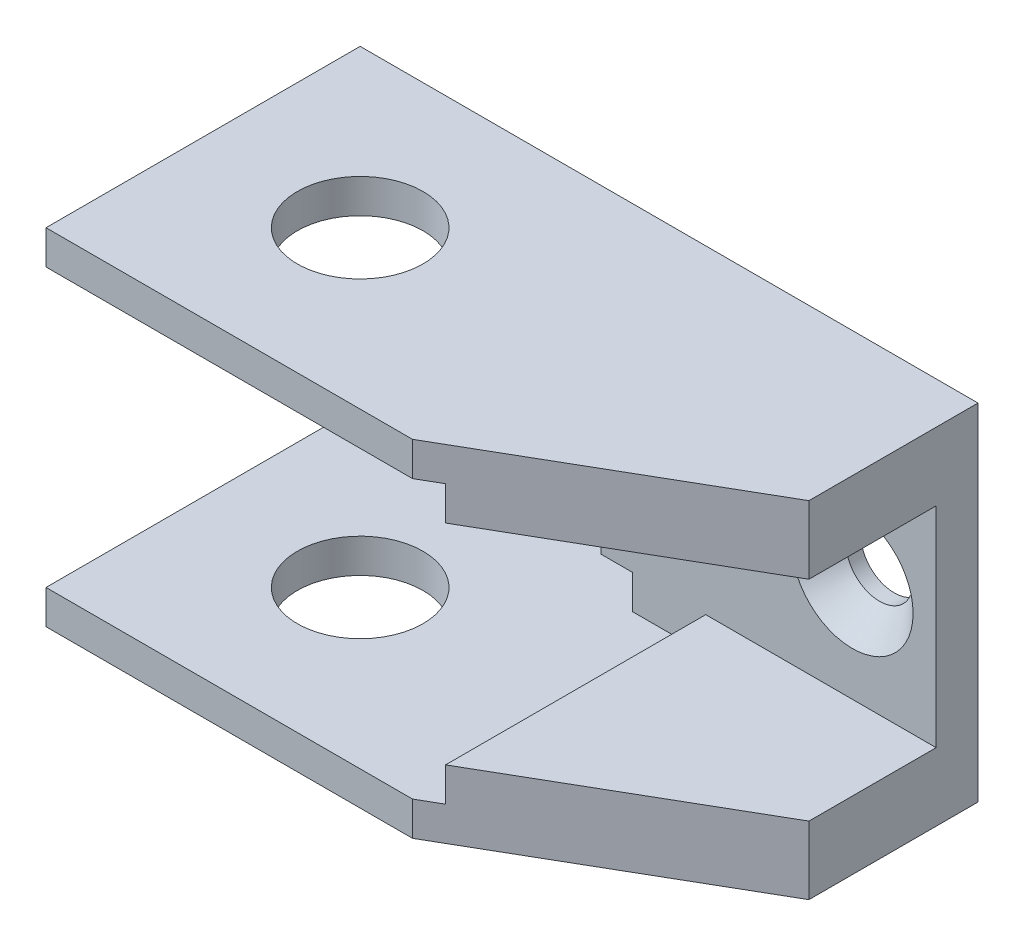
ISO-10303-21;
HEADER;
FILE_DESCRIPTION(('STEP AP214'),'2;1');
FILE_NAME('part.step','',(''),(''),'','','');
FILE_SCHEMA(('AUTOMOTIVE_DESIGN { 1 0 10303 214 1 1 1 1 }'));
ENDSEC;
DATA;
#1=APPLICATION_CONTEXT('core data for automotive mechanical design processes');
#2=APPLICATION_PROTOCOL_DEFINITION('international standard','automotive_design',2000,#1);
#3=PRODUCT_CONTEXT('',#1,'mechanical');
#4=PRODUCT('Part','Part','',(#3));
#5=PRODUCT_RELATED_PRODUCT_CATEGORY('part','',(#4));
#6=PRODUCT_DEFINITION_FORMATION('','',#4);
#7=PRODUCT_DEFINITION_CONTEXT('part definition',#1,'design');
#8=PRODUCT_DEFINITION('design','',#6,#7);
#9=PRODUCT_DEFINITION_SHAPE('','',#8);
#10=(LENGTH_UNIT() NAMED_UNIT(*) SI_UNIT(.MILLI.,.METRE.));
#11=(NAMED_UNIT(*) PLANE_ANGLE_UNIT() SI_UNIT($,.RADIAN.));
#12=(NAMED_UNIT(*) SI_UNIT($,.STERADIAN.) SOLID_ANGLE_UNIT());
#13=UNCERTAINTY_MEASURE_WITH_UNIT(LENGTH_MEASURE(1.E-05),#10,'distance_accuracy_value','');
#14=(GEOMETRIC_REPRESENTATION_CONTEXT(3) GLOBAL_UNCERTAINTY_ASSIGNED_CONTEXT((#13)) GLOBAL_UNIT_ASSIGNED_CONTEXT((#10,
#11,#12)) REPRESENTATION_CONTEXT('',''));
#15=CARTESIAN_POINT('',(0.,0.,0.));
#16=DIRECTION('',(0.,0.,1.));
#17=DIRECTION('',(1.,0.,0.));
#18=AXIS2_PLACEMENT_3D('',#15,#16,#17);
#19=CARTESIAN_POINT('',(7.5,-5.8125,-3.75));
#20=DIRECTION('',(-1.,0.,0.));
#21=DIRECTION('',(0.,0.,1.));
#22=AXIS2_PLACEMENT_3D('',#19,#20,#21);
#23=PLANE('',#22);
#24=DIRECTION('',(0.,1.,0.));
#25=VECTOR('',#24,1.);
#26=CARTESIAN_POINT('',(7.5,-5.8125,-7.5));
#27=LINE('',#26,#25);
#28=CARTESIAN_POINT('',(7.5,-5.,-7.5));
#29=VERTEX_POINT('',#28);
#30=CARTESIAN_POINT('',(7.5,-6.625,-7.5));
#31=VERTEX_POINT('',#30);
#32=EDGE_CURVE('E167',#29,#31,#27,.F.);
#33=ORIENTED_EDGE('',*,*,#32,.T.);
#34=DIRECTION('',(0.,0.,-1.));
#35=VECTOR('',#34,1.);
#36=CARTESIAN_POINT('',(7.5,-6.625,0.));
#37=LINE('',#36,#35);
#38=CARTESIAN_POINT('',(7.5,-6.625,-5.5));
#39=VERTEX_POINT('',#38);
#40=EDGE_CURVE('E245',#31,#39,#37,.F.);
#41=ORIENTED_EDGE('',*,*,#40,.T.);
#42=DIRECTION('',(0.,1.,0.));
#43=VECTOR('',#42,1.);
#44=CARTESIAN_POINT('',(7.5,-5.8125,-5.5));
#45=LINE('',#44,#43);
#46=CARTESIAN_POINT('',(7.5,-5.,-5.5));
#47=VERTEX_POINT('',#46);
#48=EDGE_CURVE('E149',#39,#47,#45,.T.);
#49=ORIENTED_EDGE('',*,*,#48,.T.);
#50=DIRECTION('',(0.,0.,-1.));
#51=VECTOR('',#50,1.);
#52=CARTESIAN_POINT('',(7.5,-5.,-3.75));
#53=LINE('',#52,#51);
#54=EDGE_CURVE('E157',#29,#47,#53,.F.);
#55=ORIENTED_EDGE('',*,*,#54,.F.);
#56=EDGE_LOOP('',(#33,#41,#49,#55));
#57=FACE_BOUND('',#56,.T.);
#58=ADVANCED_FACE('F16',(#57),#23,.T.);
#59=CARTESIAN_POINT('',(3.75,5.,-3.75));
#60=DIRECTION('',(0.,-1.,0.));
#61=DIRECTION('',(0.,0.,-1.));
#62=AXIS2_PLACEMENT_3D('',#59,#60,#61);
#63=PLANE('',#62);
#64=DIRECTION('',(0.,0.,1.));
#65=VECTOR('',#64,1.);
#66=CARTESIAN_POINT('',(7.5,5.,-3.75));
#67=LINE('',#66,#65);
#68=CARTESIAN_POINT('',(7.5,5.,-7.5));
#69=VERTEX_POINT('',#68);
#70=CARTESIAN_POINT('',(7.5,5.,-5.5));
#71=VERTEX_POINT('',#70);
#72=EDGE_CURVE('E256',#69,#71,#67,.T.);
#73=ORIENTED_EDGE('',*,*,#72,.F.);
#74=DIRECTION('',(1.,0.,0.));
#75=VECTOR('',#74,1.);
#76=CARTESIAN_POINT('',(3.75,5.,-7.5));
#77=LINE('',#76,#75);
#78=CARTESIAN_POINT('',(6.,5.,-7.5));
#79=VERTEX_POINT('',#78);
#80=EDGE_CURVE('E173',#79,#69,#77,.T.);
#81=ORIENTED_EDGE('',*,*,#80,.F.);
#82=DIRECTION('',(0.,0.,1.));
#83=VECTOR('',#82,1.);
#84=CARTESIAN_POINT('',(6.,5.,-5.5));
#85=LINE('',#84,#83);
#86=CARTESIAN_POINT('',(6.,5.,-5.5));
#87=VERTEX_POINT('',#86);
#88=EDGE_CURVE('E242',#87,#79,#85,.F.);
#89=ORIENTED_EDGE('',*,*,#88,.F.);
#90=DIRECTION('',(1.,0.,0.));
#91=VECTOR('',#90,1.);
#92=CARTESIAN_POINT('',(3.75,5.,-5.5));
#93=LINE('',#92,#91);
#94=EDGE_CURVE('E164',#71,#87,#93,.F.);
#95=ORIENTED_EDGE('',*,*,#94,.F.);
#96=EDGE_LOOP('',(#73,#81,#89,#95));
#97=FACE_BOUND('',#96,.T.);
#98=ADVANCED_FACE('F377',(#97),#63,.F.);
#99=CARTESIAN_POINT('',(3.75,-5.,-3.75));
#100=DIRECTION('',(0.,-1.,0.));
#101=DIRECTION('',(0.,0.,-1.));
#102=AXIS2_PLACEMENT_3D('',#99,#100,#101);
#103=PLANE('',#102);
#104=ORIENTED_EDGE('',*,*,#54,.T.);
#105=DIRECTION('',(1.,0.,0.));
#106=VECTOR('',#105,1.);
#107=CARTESIAN_POINT('',(3.75,-5.,-5.5));
#108=LINE('',#107,#106);
#109=CARTESIAN_POINT('',(6.,-5.,-5.5));
#110=VERTEX_POINT('',#109);
#111=EDGE_CURVE('E175',#47,#110,#108,.F.);
#112=ORIENTED_EDGE('',*,*,#111,.T.);
#113=DIRECTION('',(0.,0.,1.));
#114=VECTOR('',#113,1.);
#115=CARTESIAN_POINT('',(6.,-5.,-5.5));
#116=LINE('',#115,#114);
#117=CARTESIAN_POINT('',(6.,-5.,-7.5));
#118=VERTEX_POINT('',#117);
#119=EDGE_CURVE('E160',#118,#110,#116,.T.);
#120=ORIENTED_EDGE('',*,*,#119,.F.);
#121=DIRECTION('',(1.,0.,0.));
#122=VECTOR('',#121,1.);
#123=CARTESIAN_POINT('',(3.75,-5.,-7.5));
#124=LINE('',#123,#122);
#125=EDGE_CURVE('E154',#118,#29,#124,.T.);
#126=ORIENTED_EDGE('',*,*,#125,.T.);
#127=EDGE_LOOP('',(#104,#112,#120,#126));
#128=FACE_BOUND('',#127,.T.);
#129=ADVANCED_FACE('F156',(#128),#103,.T.);
#130=CARTESIAN_POINT('',(11.,0.,0.));
#131=DIRECTION('',(-1.,0.,0.));
#132=DIRECTION('',(0.,0.,1.));
#133=AXIS2_PLACEMENT_3D('',#130,#131,#132);
#134=PLANE('',#133);
#135=DIRECTION('',(0.,1.,0.));
#136=VECTOR('',#135,1.);
#137=CARTESIAN_POINT('',(11.,0.,6.92264973081037));
#138=LINE('',#137,#136);
#139=CARTESIAN_POINT('',(11.,-6.625,6.92264973081037));
#140=VERTEX_POINT('',#139);
#141=CARTESIAN_POINT('',(11.,-5.,6.92264973081037));
#142=VERTEX_POINT('',#141);
#143=EDGE_CURVE('E266',#140,#142,#138,.T.);
#144=ORIENTED_EDGE('',*,*,#143,.T.);
#145=DIRECTION('',(0.,0.,-1.));
#146=VECTOR('',#145,1.);
#147=CARTESIAN_POINT('',(11.,-5.,0.));
#148=LINE('',#147,#146);
#149=CARTESIAN_POINT('',(11.,-5.,-5.5));
#150=VERTEX_POINT('',#149);
#151=EDGE_CURVE('E238',#142,#150,#148,.T.);
#152=ORIENTED_EDGE('',*,*,#151,.T.);
#153=DIRECTION('',(0.,1.,0.));
#154=VECTOR('',#153,1.);
#155=CARTESIAN_POINT('',(11.,0.,-5.5));
#156=LINE('',#155,#154);
#157=CARTESIAN_POINT('',(11.,-6.625,-5.5));
#158=VERTEX_POINT('',#157);
#159=EDGE_CURVE('E177',#150,#158,#156,.F.);
#160=ORIENTED_EDGE('',*,*,#159,.T.);
#161=DIRECTION('',(0.,0.,-1.));
#162=VECTOR('',#161,1.);
#163=CARTESIAN_POINT('',(11.,-6.625,0.));
#164=LINE('',#163,#162);
#165=EDGE_CURVE('E188',#158,#140,#164,.F.);
#166=ORIENTED_EDGE('',*,*,#165,.T.);
#167=EDGE_LOOP('',(#144,#152,#160,#166));
#168=FACE_BOUND('',#167,.T.);
#169=ADVANCED_FACE('F269',(#168),#134,.T.);
#170=CARTESIAN_POINT('',(0.,0.,0.));
#171=DIRECTION('',(0.,-1.,0.));
#172=DIRECTION('',(0.,0.,-1.));
#173=AXIS2_PLACEMENT_3D('',#170,#171,#172);
#174=CYLINDRICAL_SURFACE('',#173,3.);
#175=CARTESIAN_POINT('',(0.,-8.25,0.));
#176=DIRECTION('',(0.,-1.,0.));
#177=DIRECTION('',(0.,0.,-1.));
#178=AXIS2_PLACEMENT_3D('',#175,#176,#177);
#179=CIRCLE('',#178,3.);
#180=CARTESIAN_POINT('',(0.,-8.25,-3.));
#181=VERTEX_POINT('',#180);
#182=EDGE_CURVE('E217',#181,#181,#179,.F.);
#183=ORIENTED_EDGE('',*,*,#182,.F.);
#184=EDGE_LOOP('',(#183));
#185=FACE_BOUND('',#184,.T.);
#186=CARTESIAN_POINT('',(0.,-6.625,0.));
#187=DIRECTION('',(0.,-1.,0.));
#188=DIRECTION('',(0.,0.,-1.));
#189=AXIS2_PLACEMENT_3D('',#186,#187,#188);
#190=CIRCLE('',#189,3.);
#191=CARTESIAN_POINT('',(0.,-6.625,-3.));
#192=VERTEX_POINT('',#191);
#193=EDGE_CURVE('E19',#192,#192,#190,.F.);
#194=ORIENTED_EDGE('',*,*,#193,.T.);
#195=EDGE_LOOP('',(#194));
#196=FACE_BOUND('',#195,.T.);
#197=ADVANCED_FACE('F484',(#185,#196),#174,.F.);
#198=CARTESIAN_POINT('',(10.,-8.25,7.5));
#199=DIRECTION('',(0.,0.,1.));
#200=DIRECTION('',(1.,0.,0.));
#201=AXIS2_PLACEMENT_3D('',#198,#199,#200);
#202=PLANE('',#201);
#203=DIRECTION('',(1.,0.,0.));
#204=VECTOR('',#203,1.);
#205=CARTESIAN_POINT('',(7.61195926998478,-8.25,7.5));
#206=LINE('',#205,#204);
#207=CARTESIAN_POINT('',(10.,-8.25,7.5));
#208=VERTEX_POINT('',#207);
#209=CARTESIAN_POINT('',(-7.5,-8.25,7.5));
#210=VERTEX_POINT('',#209);
#211=EDGE_CURVE('E224',#208,#210,#206,.F.);
#212=ORIENTED_EDGE('',*,*,#211,.F.);
#213=DIRECTION('',(0.,1.,0.));
#214=VECTOR('',#213,1.);
#215=CARTESIAN_POINT('',(10.,-8.25,7.5));
#216=LINE('',#215,#214);
#217=CARTESIAN_POINT('',(10.,-6.625,7.5));
#218=VERTEX_POINT('',#217);
#219=EDGE_CURVE('E220',#218,#208,#216,.F.);
#220=ORIENTED_EDGE('',*,*,#219,.F.);
#221=DIRECTION('',(1.,0.,0.));
#222=VECTOR('',#221,1.);
#223=CARTESIAN_POINT('',(1.75,-6.625,7.5));
#224=LINE('',#223,#222);
#225=CARTESIAN_POINT('',(-7.5,-6.625,7.5));
#226=VERTEX_POINT('',#225);
#227=EDGE_CURVE('E250',#218,#226,#224,.F.);
#228=ORIENTED_EDGE('',*,*,#227,.T.);
#229=DIRECTION('',(0.,1.,0.));
#230=VECTOR('',#229,1.);
#231=CARTESIAN_POINT('',(-7.5,0.,7.5));
#232=LINE('',#231,#230);
#233=EDGE_CURVE('E263',#226,#210,#232,.F.);
#234=ORIENTED_EDGE('',*,*,#233,.T.);
#235=EDGE_LOOP('',(#212,#220,#228,#234));
#236=FACE_BOUND('',#235,.T.);
#237=ADVANCED_FACE('F300',(#236),#202,.T.);
#238=CARTESIAN_POINT('',(-7.5,0.,0.));
#239=DIRECTION('',(1.,0.,0.));
#240=DIRECTION('',(0.,0.,-1.));
#241=AXIS2_PLACEMENT_3D('',#238,#239,#240);
#242=PLANE('',#241);
#243=DIRECTION('',(0.,1.,0.));
#244=VECTOR('',#243,1.);
#245=CARTESIAN_POINT('',(-7.5,0.,-7.5));
#246=LINE('',#245,#244);
#247=CARTESIAN_POINT('',(-7.5,-8.25,-7.5));
#248=VERTEX_POINT('',#247);
#249=CARTESIAN_POINT('',(-7.5,-6.625,-7.5));
#250=VERTEX_POINT('',#249);
#251=EDGE_CURVE('E261',#248,#250,#246,.T.);
#252=ORIENTED_EDGE('',*,*,#251,.F.);
#253=DIRECTION('',(0.,0.,-1.));
#254=VECTOR('',#253,1.);
#255=CARTESIAN_POINT('',(-7.5,-8.25,-0.800598234334194));
#256=LINE('',#255,#254);
#257=EDGE_CURVE('E287',#210,#248,#256,.T.);
#258=ORIENTED_EDGE('',*,*,#257,.F.);
#259=ORIENTED_EDGE('',*,*,#233,.F.);
#260=DIRECTION('',(0.,0.,-1.));
#261=VECTOR('',#260,1.);
#262=CARTESIAN_POINT('',(-7.5,-6.625,0.));
#263=LINE('',#262,#261);
#264=EDGE_CURVE('E247',#226,#250,#263,.T.);
#265=ORIENTED_EDGE('',*,*,#264,.T.);
#266=EDGE_LOOP('',(#252,#258,#259,#265));
#267=FACE_BOUND('',#266,.T.);
#268=ADVANCED_FACE('F303',(#267),#242,.F.);
#269=CARTESIAN_POINT('',(10.,0.,-5.50000000004047));
#270=DIRECTION('',(0.,0.,1.));
#271=DIRECTION('',(1.,0.,0.));
#272=AXIS2_PLACEMENT_3D('',#269,#270,#271);
#273=CONICAL_SURFACE('',#272,2.89999999988822,0.785398163419311);
#274=CARTESIAN_POINT('',(10.,0.,-5.49999999997453));
#275=DIRECTION('',(0.,0.,1.));
#276=DIRECTION('',(1.,0.,0.));
#277=AXIS2_PLACEMENT_3D('',#274,#275,#276);
#278=CIRCLE('',#277,2.89999999995416);
#279=CARTESIAN_POINT('',(12.8999999999542,0.,-5.49999999997453));
#280=VERTEX_POINT('',#279);
#281=EDGE_CURVE('E214',#280,#280,#278,.F.);
#282=ORIENTED_EDGE('',*,*,#281,.F.);
#283=EDGE_LOOP('',(#282));
#284=FACE_BOUND('',#283,.T.);
#285=CARTESIAN_POINT('',(10.,0.,-6.8));
#286=DIRECTION('',(0.,0.,-1.));
#287=DIRECTION('',(-1.,0.,0.));
#288=AXIS2_PLACEMENT_3D('',#285,#286,#287);
#289=CIRCLE('',#288,1.6);
#290=CARTESIAN_POINT('',(8.4,0.,-6.8));
#291=VERTEX_POINT('',#290);
#292=EDGE_CURVE('E189',#291,#291,#289,.T.);
#293=ORIENTED_EDGE('',*,*,#292,.T.);
#294=EDGE_LOOP('',(#293));
#295=FACE_BOUND('',#294,.T.);
#296=ADVANCED_FACE('F453',(#284,#295),#273,.F.);
#297=CARTESIAN_POINT('',(18.,0.,-5.49999999992679));
#298=DIRECTION('',(0.,0.,1.));
#299=DIRECTION('',(1.,0.,0.));
#300=AXIS2_PLACEMENT_3D('',#297,#298,#299);
#301=CONICAL_SURFACE('',#300,2.89999999998326,0.785398163419311);
#302=CARTESIAN_POINT('',(18.,0.,-5.49999999995589));
#303=DIRECTION('',(0.,0.,1.));
#304=DIRECTION('',(1.,0.,0.));
#305=AXIS2_PLACEMENT_3D('',#302,#303,#304);
#306=CIRCLE('',#305,2.89999999995416);
#307=CARTESIAN_POINT('',(20.8999999999542,0.,-5.49999999995589));
#308=VERTEX_POINT('',#307);
#309=EDGE_CURVE('E210',#308,#308,#306,.F.);
#310=ORIENTED_EDGE('',*,*,#309,.F.);
#311=EDGE_LOOP('',(#310));
#312=FACE_BOUND('',#311,.T.);
#313=CARTESIAN_POINT('',(18.,0.,-6.8));
#314=DIRECTION('',(0.,0.,-1.));
#315=DIRECTION('',(-1.,0.,0.));
#316=AXIS2_PLACEMENT_3D('',#313,#314,#315);
#317=CIRCLE('',#316,1.6);
#318=CARTESIAN_POINT('',(16.4,0.,-6.8));
#319=VERTEX_POINT('',#318);
#320=EDGE_CURVE('E185',#319,#319,#317,.T.);
#321=ORIENTED_EDGE('',*,*,#320,.T.);
#322=EDGE_LOOP('',(#321));
#323=FACE_BOUND('',#322,.T.);
#324=ADVANCED_FACE('F456',(#312,#323),#301,.F.);
#325=CARTESIAN_POINT('',(7.5,5.8125,-3.75));
#326=DIRECTION('',(-1.,0.,0.));
#327=DIRECTION('',(0.,0.,1.));
#328=AXIS2_PLACEMENT_3D('',#325,#326,#327);
#329=PLANE('',#328);
#330=DIRECTION('',(0.,1.,0.));
#331=VECTOR('',#330,1.);
#332=CARTESIAN_POINT('',(7.5,5.8125,-7.5));
#333=LINE('',#332,#331);
#334=CARTESIAN_POINT('',(7.5,6.625,-7.5));
#335=VERTEX_POINT('',#334);
#336=EDGE_CURVE('E259',#335,#69,#333,.F.);
#337=ORIENTED_EDGE('',*,*,#336,.T.);
#338=ORIENTED_EDGE('',*,*,#72,.T.);
#339=DIRECTION('',(0.,1.,0.));
#340=VECTOR('',#339,1.);
#341=CARTESIAN_POINT('',(7.5,-6.625,-5.5));
#342=LINE('',#341,#340);
#343=CARTESIAN_POINT('',(7.5,6.625,-5.5));
#344=VERTEX_POINT('',#343);
#345=EDGE_CURVE('E216',#344,#71,#342,.F.);
#346=ORIENTED_EDGE('',*,*,#345,.F.);
#347=DIRECTION('',(0.,0.,-1.));
#348=VECTOR('',#347,1.);
#349=CARTESIAN_POINT('',(7.5,6.625,0.));
#350=LINE('',#349,#348);
#351=EDGE_CURVE('E319',#335,#344,#350,.F.);
#352=ORIENTED_EDGE('',*,*,#351,.F.);
#353=EDGE_LOOP('',(#337,#338,#346,#352));
#354=FACE_BOUND('',#353,.T.);
#355=ADVANCED_FACE('F379',(#354),#329,.T.);
#356=CARTESIAN_POINT('',(11.,0.,0.));
#357=DIRECTION('',(-1.,0.,0.));
#358=DIRECTION('',(0.,0.,1.));
#359=AXIS2_PLACEMENT_3D('',#356,#357,#358);
#360=PLANE('',#359);
#361=DIRECTION('',(0.,1.,0.));
#362=VECTOR('',#361,1.);
#363=CARTESIAN_POINT('',(11.,0.,6.92264973081037));
#364=LINE('',#363,#362);
#365=CARTESIAN_POINT('',(11.,5.,6.92264973081037));
#366=VERTEX_POINT('',#365);
#367=CARTESIAN_POINT('',(11.,6.625,6.92264973081037));
#368=VERTEX_POINT('',#367);
#369=EDGE_CURVE('E192',#366,#368,#364,.T.);
#370=ORIENTED_EDGE('',*,*,#369,.T.);
#371=DIRECTION('',(0.,0.,-1.));
#372=VECTOR('',#371,1.);
#373=CARTESIAN_POINT('',(11.,6.625,0.));
#374=LINE('',#373,#372);
#375=CARTESIAN_POINT('',(11.,6.625,-5.5));
#376=VERTEX_POINT('',#375);
#377=EDGE_CURVE('E209',#376,#368,#374,.F.);
#378=ORIENTED_EDGE('',*,*,#377,.F.);
#379=DIRECTION('',(0.,1.,0.));
#380=VECTOR('',#379,1.);
#381=CARTESIAN_POINT('',(11.,-6.625,-5.5));
#382=LINE('',#381,#380);
#383=CARTESIAN_POINT('',(11.,5.,-5.5));
#384=VERTEX_POINT('',#383);
#385=EDGE_CURVE('E284',#384,#376,#382,.T.);
#386=ORIENTED_EDGE('',*,*,#385,.F.);
#387=DIRECTION('',(0.,0.,-1.));
#388=VECTOR('',#387,1.);
#389=CARTESIAN_POINT('',(11.,5.,0.));
#390=LINE('',#389,#388);
#391=EDGE_CURVE('E321',#366,#384,#390,.T.);
#392=ORIENTED_EDGE('',*,*,#391,.F.);
#393=EDGE_LOOP('',(#370,#378,#386,#392));
#394=FACE_BOUND('',#393,.T.);
#395=ADVANCED_FACE('F338',(#394),#360,.T.);
#396=CARTESIAN_POINT('',(10.,0.,-7.15));
#397=DIRECTION('',(0.,0.,-1.));
#398=DIRECTION('',(-1.,0.,0.));
#399=AXIS2_PLACEMENT_3D('',#396,#397,#398);
#400=CYLINDRICAL_SURFACE('',#399,1.6);
#401=CARTESIAN_POINT('',(10.,0.,-7.5));
#402=DIRECTION('',(0.,0.,-1.));
#403=DIRECTION('',(-1.,0.,0.));
#404=AXIS2_PLACEMENT_3D('',#401,#402,#403);
#405=CIRCLE('',#404,1.6);
#406=CARTESIAN_POINT('',(8.4,0.,-7.5));
#407=VERTEX_POINT('',#406);
#408=EDGE_CURVE('E202',#407,#407,#405,.F.);
#409=ORIENTED_EDGE('',*,*,#408,.F.);
#410=EDGE_LOOP('',(#409));
#411=FACE_BOUND('',#410,.T.);
#412=ORIENTED_EDGE('',*,*,#292,.F.);
#413=EDGE_LOOP('',(#412));
#414=FACE_BOUND('',#413,.T.);
#415=ADVANCED_FACE('F460',(#411,#414),#400,.F.);
#416=CARTESIAN_POINT('',(18.,0.,-7.15));
#417=DIRECTION('',(0.,0.,-1.));
#418=DIRECTION('',(-1.,0.,0.));
#419=AXIS2_PLACEMENT_3D('',#416,#417,#418);
#420=CYLINDRICAL_SURFACE('',#419,1.6);
#421=CARTESIAN_POINT('',(18.,0.,-7.5));
#422=DIRECTION('',(0.,0.,-1.));
#423=DIRECTION('',(-1.,0.,0.));
#424=AXIS2_PLACEMENT_3D('',#421,#422,#423);
#425=CIRCLE('',#424,1.6);
#426=CARTESIAN_POINT('',(16.4,0.,-7.5));
#427=VERTEX_POINT('',#426);
#428=EDGE_CURVE('E198',#427,#427,#425,.F.);
#429=ORIENTED_EDGE('',*,*,#428,.F.);
#430=EDGE_LOOP('',(#429));
#431=FACE_BOUND('',#430,.T.);
#432=ORIENTED_EDGE('',*,*,#320,.F.);
#433=EDGE_LOOP('',(#432));
#434=FACE_BOUND('',#433,.T.);
#435=ADVANCED_FACE('F462',(#431,#434),#420,.F.);
#436=CARTESIAN_POINT('',(1.75,-6.625,0.));
#437=DIRECTION('',(0.,-1.,0.));
#438=DIRECTION('',(0.,0.,-1.));
#439=AXIS2_PLACEMENT_3D('',#436,#437,#438);
#440=PLANE('',#439);
#441=ORIENTED_EDGE('',*,*,#193,.F.);
#442=EDGE_LOOP('',(#441));
#443=FACE_BOUND('',#442,.T.);
#444=ORIENTED_EDGE('',*,*,#40,.F.);
#445=DIRECTION('',(-1.,0.,0.));
#446=VECTOR('',#445,1.);
#447=CARTESIAN_POINT('',(0.,-6.625,-7.5));
#448=LINE('',#447,#446);
#449=EDGE_CURVE('E171',#250,#31,#448,.F.);
#450=ORIENTED_EDGE('',*,*,#449,.F.);
#451=ORIENTED_EDGE('',*,*,#264,.F.);
#452=ORIENTED_EDGE('',*,*,#227,.F.);
#453=DIRECTION('',(0.866025403784439,0.,-0.5));
#454=VECTOR('',#453,1.);
#455=CARTESIAN_POINT('',(22.,-6.625,0.571796769724493));
#456=LINE('',#455,#454);
#457=EDGE_CURVE('E226',#140,#218,#456,.F.);
#458=ORIENTED_EDGE('',*,*,#457,.F.);
#459=ORIENTED_EDGE('',*,*,#165,.F.);
#460=DIRECTION('',(1.,0.,0.));
#461=VECTOR('',#460,1.);
#462=CARTESIAN_POINT('',(22.,-6.625,-5.5));
#463=LINE('',#462,#461);
#464=EDGE_CURVE('E278',#39,#158,#463,.T.);
#465=ORIENTED_EDGE('',*,*,#464,.F.);
#466=EDGE_LOOP('',(#444,#450,#451,#452,#458,#459,#465));
#467=FACE_BOUND('',#466,.T.);
#468=ADVANCED_FACE('F277',(#443,#467),#440,.F.);
#469=CARTESIAN_POINT('',(6.,-6.625,-5.5));
#470=DIRECTION('',(-1.,0.,0.));
#471=DIRECTION('',(0.,0.,1.));
#472=AXIS2_PLACEMENT_3D('',#469,#470,#471);
#473=PLANE('',#472);
#474=ORIENTED_EDGE('',*,*,#119,.T.);
#475=DIRECTION('',(0.,1.,0.));
#476=VECTOR('',#475,1.);
#477=CARTESIAN_POINT('',(6.,-6.625,-5.5));
#478=LINE('',#477,#476);
#479=EDGE_CURVE('E282',#87,#110,#478,.F.);
#480=ORIENTED_EDGE('',*,*,#479,.F.);
#481=ORIENTED_EDGE('',*,*,#88,.T.);
#482=DIRECTION('',(0.,1.,0.));
#483=VECTOR('',#482,1.);
#484=CARTESIAN_POINT('',(6.,-8.25,-7.5));
#485=LINE('',#484,#483);
#486=EDGE_CURVE('E308',#118,#79,#485,.T.);
#487=ORIENTED_EDGE('',*,*,#486,.F.);
#488=EDGE_LOOP('',(#474,#480,#481,#487));
#489=FACE_BOUND('',#488,.T.);
#490=ADVANCED_FACE('F373',(#489),#473,.T.);
#491=CARTESIAN_POINT('',(9.5,-5.,0.));
#492=DIRECTION('',(0.,-1.,0.));
#493=DIRECTION('',(0.,0.,-1.));
#494=AXIS2_PLACEMENT_3D('',#491,#492,#493);
#495=PLANE('',#494);
#496=ORIENTED_EDGE('',*,*,#151,.F.);
#497=DIRECTION('',(0.866025403784439,0.,-0.5));
#498=VECTOR('',#497,1.);
#499=CARTESIAN_POINT('',(22.,-5.,0.571796769724493));
#500=LINE('',#499,#498);
#501=CARTESIAN_POINT('',(22.,-5.,0.571796769724493));
#502=VERTEX_POINT('',#501);
#503=EDGE_CURVE('E232',#502,#142,#500,.F.);
#504=ORIENTED_EDGE('',*,*,#503,.F.);
#505=DIRECTION('',(0.,0.,-1.));
#506=VECTOR('',#505,1.);
#507=CARTESIAN_POINT('',(22.,-5.,-7.5));
#508=LINE('',#507,#506);
#509=CARTESIAN_POINT('',(22.,-5.,-5.5));
#510=VERTEX_POINT('',#509);
#511=EDGE_CURVE('E366',#510,#502,#508,.F.);
#512=ORIENTED_EDGE('',*,*,#511,.F.);
#513=DIRECTION('',(1.,0.,0.));
#514=VECTOR('',#513,1.);
#515=CARTESIAN_POINT('',(22.,-5.,-5.5));
#516=LINE('',#515,#514);
#517=EDGE_CURVE('E281',#150,#510,#516,.T.);
#518=ORIENTED_EDGE('',*,*,#517,.F.);
#519=EDGE_LOOP('',(#496,#504,#512,#518));
#520=FACE_BOUND('',#519,.T.);
#521=ADVANCED_FACE('F409',(#520),#495,.F.);
#522=CARTESIAN_POINT('',(22.,-8.25,0.571796769724493));
#523=DIRECTION('',(0.5,0.,0.866025403784439));
#524=DIRECTION('',(0.866025403784439,0.,-0.5));
#525=AXIS2_PLACEMENT_3D('',#522,#523,#524);
#526=PLANE('',#525);
#527=DIRECTION('',(-0.866025403784439,0.,0.5));
#528=VECTOR('',#527,1.);
#529=CARTESIAN_POINT('',(22.,-8.25,0.571796769724493));
#530=LINE('',#529,#528);
#531=CARTESIAN_POINT('',(22.,-8.25,0.571796769724493));
#532=VERTEX_POINT('',#531);
#533=EDGE_CURVE('E219',#532,#208,#530,.T.);
#534=ORIENTED_EDGE('',*,*,#533,.F.);
#535=DIRECTION('',(0.,1.,0.));
#536=VECTOR('',#535,1.);
#537=CARTESIAN_POINT('',(22.,-8.25,0.571796769724494));
#538=LINE('',#537,#536);
#539=EDGE_CURVE('E364',#502,#532,#538,.F.);
#540=ORIENTED_EDGE('',*,*,#539,.F.);
#541=ORIENTED_EDGE('',*,*,#503,.T.);
#542=ORIENTED_EDGE('',*,*,#143,.F.);
#543=ORIENTED_EDGE('',*,*,#457,.T.);
#544=ORIENTED_EDGE('',*,*,#219,.T.);
#545=EDGE_LOOP('',(#534,#540,#541,#542,#543,#544));
#546=FACE_BOUND('',#545,.T.);
#547=ADVANCED_FACE('F407',(#546),#526,.T.);
#548=CARTESIAN_POINT('',(7.61195926998478,-8.25,-0.800598234334194));
#549=DIRECTION('',(0.,-1.,0.));
#550=DIRECTION('',(0.,0.,-1.));
#551=AXIS2_PLACEMENT_3D('',#548,#549,#550);
#552=PLANE('',#551);
#553=ORIENTED_EDGE('',*,*,#211,.T.);
#554=ORIENTED_EDGE('',*,*,#257,.T.);
#555=DIRECTION('',(-1.,0.,0.));
#556=VECTOR('',#555,1.);
#557=CARTESIAN_POINT('',(0.,-8.25,-7.5));
#558=LINE('',#557,#556);
#559=CARTESIAN_POINT('',(22.,-8.25,-7.5));
#560=VERTEX_POINT('',#559);
#561=EDGE_CURVE('E201',#560,#248,#558,.T.);
#562=ORIENTED_EDGE('',*,*,#561,.F.);
#563=DIRECTION('',(0.,0.,-1.));
#564=VECTOR('',#563,1.);
#565=CARTESIAN_POINT('',(22.,-8.25,-7.5));
#566=LINE('',#565,#564);
#567=EDGE_CURVE('E362',#532,#560,#566,.T.);
#568=ORIENTED_EDGE('',*,*,#567,.F.);
#569=ORIENTED_EDGE('',*,*,#533,.T.);
#570=EDGE_LOOP('',(#553,#554,#562,#568,#569));
#571=FACE_BOUND('',#570,.T.);
#572=ORIENTED_EDGE('',*,*,#182,.T.);
#573=EDGE_LOOP('',(#572));
#574=FACE_BOUND('',#573,.T.);
#575=ADVANCED_FACE('F294',(#571,#574),#552,.T.);
#576=CARTESIAN_POINT('',(22.,-6.625,-5.5));
#577=DIRECTION('',(0.,0.,1.));
#578=DIRECTION('',(1.,0.,0.));
#579=AXIS2_PLACEMENT_3D('',#576,#577,#578);
#580=PLANE('',#579);
#581=ORIENTED_EDGE('',*,*,#309,.T.);
#582=EDGE_LOOP('',(#581));
#583=FACE_BOUND('',#582,.T.);
#584=ORIENTED_EDGE('',*,*,#281,.T.);
#585=EDGE_LOOP('',(#584));
#586=FACE_BOUND('',#585,.T.);
#587=DIRECTION('',(1.,0.,0.));
#588=VECTOR('',#587,1.);
#589=CARTESIAN_POINT('',(1.75,6.625,-5.5));
#590=LINE('',#589,#588);
#591=EDGE_CURVE('E316',#344,#376,#590,.T.);
#592=ORIENTED_EDGE('',*,*,#591,.F.);
#593=ORIENTED_EDGE('',*,*,#345,.T.);
#594=ORIENTED_EDGE('',*,*,#94,.T.);
#595=ORIENTED_EDGE('',*,*,#479,.T.);
#596=ORIENTED_EDGE('',*,*,#111,.F.);
#597=ORIENTED_EDGE('',*,*,#48,.F.);
#598=ORIENTED_EDGE('',*,*,#464,.T.);
#599=ORIENTED_EDGE('',*,*,#159,.F.);
#600=ORIENTED_EDGE('',*,*,#517,.T.);
#601=DIRECTION('',(0.,1.,0.));
#602=VECTOR('',#601,1.);
#603=CARTESIAN_POINT('',(22.,-8.25,-5.5));
#604=LINE('',#603,#602);
#605=CARTESIAN_POINT('',(22.,5.,-5.5));
#606=VERTEX_POINT('',#605);
#607=EDGE_CURVE('E355',#606,#510,#604,.F.);
#608=ORIENTED_EDGE('',*,*,#607,.F.);
#609=DIRECTION('',(1.,0.,0.));
#610=VECTOR('',#609,1.);
#611=CARTESIAN_POINT('',(9.5,5.,-5.5));
#612=LINE('',#611,#610);
#613=EDGE_CURVE('E213',#384,#606,#612,.T.);
#614=ORIENTED_EDGE('',*,*,#613,.F.);
#615=ORIENTED_EDGE('',*,*,#385,.T.);
#616=EDGE_LOOP('',(#592,#593,#594,#595,#596,#597,#598,#599,#600,#608,#614,#615));
#617=FACE_BOUND('',#616,.T.);
#618=ADVANCED_FACE('F280',(#583,#586,#617),#580,.T.);
#619=CARTESIAN_POINT('',(9.5,5.,0.));
#620=DIRECTION('',(0.,-1.,0.));
#621=DIRECTION('',(0.,0.,-1.));
#622=AXIS2_PLACEMENT_3D('',#619,#620,#621);
#623=PLANE('',#622);
#624=DIRECTION('',(0.866025403784439,0.,-0.5));
#625=VECTOR('',#624,1.);
#626=CARTESIAN_POINT('',(22.,5.00000000000001,0.571796769724493));
#627=LINE('',#626,#625);
#628=CARTESIAN_POINT('',(22.,5.,0.571796769724493));
#629=VERTEX_POINT('',#628);
#630=EDGE_CURVE('E342',#366,#629,#627,.T.);
#631=ORIENTED_EDGE('',*,*,#630,.F.);
#632=ORIENTED_EDGE('',*,*,#391,.T.);
#633=ORIENTED_EDGE('',*,*,#613,.T.);
#634=DIRECTION('',(0.,0.,-1.));
#635=VECTOR('',#634,1.);
#636=CARTESIAN_POINT('',(22.,5.,-7.5));
#637=LINE('',#636,#635);
#638=EDGE_CURVE('E358',#629,#606,#637,.T.);
#639=ORIENTED_EDGE('',*,*,#638,.F.);
#640=EDGE_LOOP('',(#631,#632,#633,#639));
#641=FACE_BOUND('',#640,.T.);
#642=ADVANCED_FACE('F440',(#641),#623,.T.);
#643=CARTESIAN_POINT('',(1.75,6.625,0.));
#644=DIRECTION('',(0.,-1.,0.));
#645=DIRECTION('',(0.,0.,-1.));
#646=AXIS2_PLACEMENT_3D('',#643,#644,#645);
#647=PLANE('',#646);
#648=CARTESIAN_POINT('',(0.,6.625,0.));
#649=DIRECTION('',(0.,-1.,0.));
#650=DIRECTION('',(0.,0.,-1.));
#651=AXIS2_PLACEMENT_3D('',#648,#649,#650);
#652=CIRCLE('',#651,3.);
#653=CARTESIAN_POINT('',(0.,6.625,-3.));
#654=VERTEX_POINT('',#653);
#655=EDGE_CURVE('E206',#654,#654,#652,.F.);
#656=ORIENTED_EDGE('',*,*,#655,.T.);
#657=EDGE_LOOP('',(#656));
#658=FACE_BOUND('',#657,.T.);
#659=DIRECTION('',(0.,0.,-1.));
#660=VECTOR('',#659,1.);
#661=CARTESIAN_POINT('',(-7.5,6.625,0.));
#662=LINE('',#661,#660);
#663=CARTESIAN_POINT('',(-7.5,6.625,7.5));
#664=VERTEX_POINT('',#663);
#665=CARTESIAN_POINT('',(-7.5,6.625,-7.5));
#666=VERTEX_POINT('',#665);
#667=EDGE_CURVE('E205',#664,#666,#662,.T.);
#668=ORIENTED_EDGE('',*,*,#667,.T.);
#669=DIRECTION('',(-1.,0.,0.));
#670=VECTOR('',#669,1.);
#671=CARTESIAN_POINT('',(0.,6.625,-7.5));
#672=LINE('',#671,#670);
#673=EDGE_CURVE('E370',#335,#666,#672,.T.);
#674=ORIENTED_EDGE('',*,*,#673,.F.);
#675=ORIENTED_EDGE('',*,*,#351,.T.);
#676=ORIENTED_EDGE('',*,*,#591,.T.);
#677=ORIENTED_EDGE('',*,*,#377,.T.);
#678=DIRECTION('',(0.866025403784439,0.,-0.5));
#679=VECTOR('',#678,1.);
#680=CARTESIAN_POINT('',(22.,6.62500000000001,0.571796769724493));
#681=LINE('',#680,#679);
#682=CARTESIAN_POINT('',(10.,6.625,7.5));
#683=VERTEX_POINT('',#682);
#684=EDGE_CURVE('E344',#683,#368,#681,.T.);
#685=ORIENTED_EDGE('',*,*,#684,.F.);
#686=DIRECTION('',(1.,0.,0.));
#687=VECTOR('',#686,1.);
#688=CARTESIAN_POINT('',(10.,6.625,7.5));
#689=LINE('',#688,#687);
#690=EDGE_CURVE('E347',#664,#683,#689,.T.);
#691=ORIENTED_EDGE('',*,*,#690,.F.);
#692=EDGE_LOOP('',(#668,#674,#675,#676,#677,#685,#691));
#693=FACE_BOUND('',#692,.T.);
#694=ADVANCED_FACE('F332',(#658,#693),#647,.T.);
#695=CARTESIAN_POINT('',(0.,0.,0.));
#696=DIRECTION('',(0.,-1.,0.));
#697=DIRECTION('',(0.,0.,-1.));
#698=AXIS2_PLACEMENT_3D('',#695,#696,#697);
#699=CYLINDRICAL_SURFACE('',#698,3.);
#700=ORIENTED_EDGE('',*,*,#655,.F.);
#701=EDGE_LOOP('',(#700));
#702=FACE_BOUND('',#701,.T.);
#703=CARTESIAN_POINT('',(0.,8.25,0.));
#704=DIRECTION('',(0.,-1.,0.));
#705=DIRECTION('',(0.,0.,-1.));
#706=AXIS2_PLACEMENT_3D('',#703,#704,#705);
#707=CIRCLE('',#706,3.);
#708=CARTESIAN_POINT('',(0.,8.25,-3.));
#709=VERTEX_POINT('',#708);
#710=EDGE_CURVE('E193',#709,#709,#707,.F.);
#711=ORIENTED_EDGE('',*,*,#710,.T.);
#712=EDGE_LOOP('',(#711));
#713=FACE_BOUND('',#712,.T.);
#714=ADVANCED_FACE('F434',(#702,#713),#699,.F.);
#715=CARTESIAN_POINT('',(-7.5,0.,0.));
#716=DIRECTION('',(1.,0.,0.));
#717=DIRECTION('',(0.,0.,-1.));
#718=AXIS2_PLACEMENT_3D('',#715,#716,#717);
#719=PLANE('',#718);
#720=DIRECTION('',(0.,1.,0.));
#721=VECTOR('',#720,1.);
#722=CARTESIAN_POINT('',(-7.5,-8.25,7.5));
#723=LINE('',#722,#721);
#724=CARTESIAN_POINT('',(-7.5,8.25,7.5));
#725=VERTEX_POINT('',#724);
#726=EDGE_CURVE('E197',#725,#664,#723,.F.);
#727=ORIENTED_EDGE('',*,*,#726,.F.);
#728=DIRECTION('',(0.,0.,-1.));
#729=VECTOR('',#728,1.);
#730=CARTESIAN_POINT('',(-7.5,8.25,-0.800598234334194));
#731=LINE('',#730,#729);
#732=CARTESIAN_POINT('',(-7.5,8.25,-7.5));
#733=VERTEX_POINT('',#732);
#734=EDGE_CURVE('E196',#725,#733,#731,.T.);
#735=ORIENTED_EDGE('',*,*,#734,.T.);
#736=DIRECTION('',(0.,1.,0.));
#737=VECTOR('',#736,1.);
#738=CARTESIAN_POINT('',(-7.5,-8.25,-7.5));
#739=LINE('',#738,#737);
#740=EDGE_CURVE('E368',#666,#733,#739,.T.);
#741=ORIENTED_EDGE('',*,*,#740,.F.);
#742=ORIENTED_EDGE('',*,*,#667,.F.);
#743=EDGE_LOOP('',(#727,#735,#741,#742));
#744=FACE_BOUND('',#743,.T.);
#745=ADVANCED_FACE('F386',(#744),#719,.F.);
#746=CARTESIAN_POINT('',(0.,-8.25,-7.5));
#747=DIRECTION('',(0.,0.,-1.));
#748=DIRECTION('',(-1.,0.,0.));
#749=AXIS2_PLACEMENT_3D('',#746,#747,#748);
#750=PLANE('',#749);
#751=ORIENTED_EDGE('',*,*,#740,.T.);
#752=DIRECTION('',(1.,0.,0.));
#753=VECTOR('',#752,1.);
#754=CARTESIAN_POINT('',(7.61195926998478,8.25,-7.5));
#755=LINE('',#754,#753);
#756=CARTESIAN_POINT('',(22.,8.25,-7.5));
#757=VERTEX_POINT('',#756);
#758=EDGE_CURVE('E388',#733,#757,#755,.T.);
#759=ORIENTED_EDGE('',*,*,#758,.T.);
#760=DIRECTION('',(0.,1.,0.));
#761=VECTOR('',#760,1.);
#762=CARTESIAN_POINT('',(22.,-8.25,-7.5));
#763=LINE('',#762,#761);
#764=EDGE_CURVE('E306',#560,#757,#763,.T.);
#765=ORIENTED_EDGE('',*,*,#764,.F.);
#766=ORIENTED_EDGE('',*,*,#561,.T.);
#767=ORIENTED_EDGE('',*,*,#251,.T.);
#768=ORIENTED_EDGE('',*,*,#449,.T.);
#769=ORIENTED_EDGE('',*,*,#32,.F.);
#770=ORIENTED_EDGE('',*,*,#125,.F.);
#771=ORIENTED_EDGE('',*,*,#486,.T.);
#772=ORIENTED_EDGE('',*,*,#80,.T.);
#773=ORIENTED_EDGE('',*,*,#336,.F.);
#774=ORIENTED_EDGE('',*,*,#673,.T.);
#775=EDGE_LOOP('',(#751,#759,#765,#766,#767,#768,#769,#770,#771,#772,#773,#774));
#776=FACE_BOUND('',#775,.T.);
#777=ORIENTED_EDGE('',*,*,#428,.T.);
#778=EDGE_LOOP('',(#777));
#779=FACE_BOUND('',#778,.T.);
#780=ORIENTED_EDGE('',*,*,#408,.T.);
#781=EDGE_LOOP('',(#780));
#782=FACE_BOUND('',#781,.T.);
#783=ADVANCED_FACE('F168',(#776,#779,#782),#750,.T.);
#784=CARTESIAN_POINT('',(22.,-8.25,-7.5));
#785=DIRECTION('',(1.,0.,0.));
#786=DIRECTION('',(0.,0.,-1.));
#787=AXIS2_PLACEMENT_3D('',#784,#785,#786);
#788=PLANE('',#787);
#789=ORIENTED_EDGE('',*,*,#638,.T.);
#790=ORIENTED_EDGE('',*,*,#607,.T.);
#791=ORIENTED_EDGE('',*,*,#511,.T.);
#792=ORIENTED_EDGE('',*,*,#539,.T.);
#793=ORIENTED_EDGE('',*,*,#567,.T.);
#794=ORIENTED_EDGE('',*,*,#764,.T.);
#795=DIRECTION('',(0.,0.,-1.));
#796=VECTOR('',#795,1.);
#797=CARTESIAN_POINT('',(22.,8.25,-0.800598234334194));
#798=LINE('',#797,#796);
#799=CARTESIAN_POINT('',(22.,8.25,0.571796769724493));
#800=VERTEX_POINT('',#799);
#801=EDGE_CURVE('E390',#757,#800,#798,.F.);
#802=ORIENTED_EDGE('',*,*,#801,.T.);
#803=DIRECTION('',(0.,1.,0.));
#804=VECTOR('',#803,1.);
#805=CARTESIAN_POINT('',(22.,-8.25,0.571796769724493));
#806=LINE('',#805,#804);
#807=EDGE_CURVE('E348',#629,#800,#806,.T.);
#808=ORIENTED_EDGE('',*,*,#807,.F.);
#809=EDGE_LOOP('',(#789,#790,#791,#792,#793,#794,#802,#808));
#810=FACE_BOUND('',#809,.T.);
#811=ADVANCED_FACE('F403',(#810),#788,.T.);
#812=CARTESIAN_POINT('',(22.,-8.25,0.571796769724493));
#813=DIRECTION('',(0.5,0.,0.866025403784439));
#814=DIRECTION('',(0.866025403784439,0.,-0.5));
#815=AXIS2_PLACEMENT_3D('',#812,#813,#814);
#816=PLANE('',#815);
#817=ORIENTED_EDGE('',*,*,#684,.T.);
#818=ORIENTED_EDGE('',*,*,#369,.F.);
#819=ORIENTED_EDGE('',*,*,#630,.T.);
#820=ORIENTED_EDGE('',*,*,#807,.T.);
#821=DIRECTION('',(-0.866025403784439,0.,0.5));
#822=VECTOR('',#821,1.);
#823=CARTESIAN_POINT('',(22.,8.25,0.571796769724493));
#824=LINE('',#823,#822);
#825=CARTESIAN_POINT('',(10.,8.25000000000001,7.5));
#826=VERTEX_POINT('',#825);
#827=EDGE_CURVE('E25',#800,#826,#824,.T.);
#828=ORIENTED_EDGE('',*,*,#827,.T.);
#829=DIRECTION('',(0.,1.,0.));
#830=VECTOR('',#829,1.);
#831=CARTESIAN_POINT('',(10.,-8.25,7.5));
#832=LINE('',#831,#830);
#833=EDGE_CURVE('E33',#683,#826,#832,.T.);
#834=ORIENTED_EDGE('',*,*,#833,.F.);
#835=EDGE_LOOP('',(#817,#818,#819,#820,#828,#834));
#836=FACE_BOUND('',#835,.T.);
#837=ADVANCED_FACE('F341',(#836),#816,.T.);
#838=CARTESIAN_POINT('',(10.,-8.25,7.5));
#839=DIRECTION('',(0.,0.,1.));
#840=DIRECTION('',(1.,0.,0.));
#841=AXIS2_PLACEMENT_3D('',#838,#839,#840);
#842=PLANE('',#841);
#843=DIRECTION('',(1.,0.,0.));
#844=VECTOR('',#843,1.);
#845=CARTESIAN_POINT('',(7.61195926998478,8.25,7.5));
#846=LINE('',#845,#844);
#847=EDGE_CURVE('E10',#826,#725,#846,.F.);
#848=ORIENTED_EDGE('',*,*,#847,.T.);
#849=ORIENTED_EDGE('',*,*,#726,.T.);
#850=ORIENTED_EDGE('',*,*,#690,.T.);
#851=ORIENTED_EDGE('',*,*,#833,.T.);
#852=EDGE_LOOP('',(#848,#849,#850,#851));
#853=FACE_BOUND('',#852,.T.);
#854=ADVANCED_FACE('F394',(#853),#842,.T.);
#855=CARTESIAN_POINT('',(7.61195926998478,8.25,-0.800598234334194));
#856=DIRECTION('',(0.,-1.,0.));
#857=DIRECTION('',(0.,0.,-1.));
#858=AXIS2_PLACEMENT_3D('',#855,#856,#857);
#859=PLANE('',#858);
#860=ORIENTED_EDGE('',*,*,#827,.F.);
#861=ORIENTED_EDGE('',*,*,#801,.F.);
#862=ORIENTED_EDGE('',*,*,#758,.F.);
#863=ORIENTED_EDGE('',*,*,#734,.F.);
#864=ORIENTED_EDGE('',*,*,#847,.F.);
#865=EDGE_LOOP('',(#860,#861,#862,#863,#864));
#866=FACE_BOUND('',#865,.T.);
#867=ORIENTED_EDGE('',*,*,#710,.F.);
#868=EDGE_LOOP('',(#867));
#869=FACE_BOUND('',#868,.T.);
#870=ADVANCED_FACE('F396',(#866,#869),#859,.F.);
#871=CLOSED_SHELL('',(#58,#98,#129,#169,#197,#237,#268,#296,#324,#355,#395,#415,#435,#468,#490,
#521,#547,#575,#618,#642,#694,#714,#745,#783,#811,#837,#854,#870));
#872=MANIFOLD_SOLID_BREP('B1',#871);
#873=ADVANCED_BREP_SHAPE_REPRESENTATION('',(#18,#872),#14);
#874=SHAPE_DEFINITION_REPRESENTATION(#9,#873);
ENDSEC;
END-ISO-10303-21;
